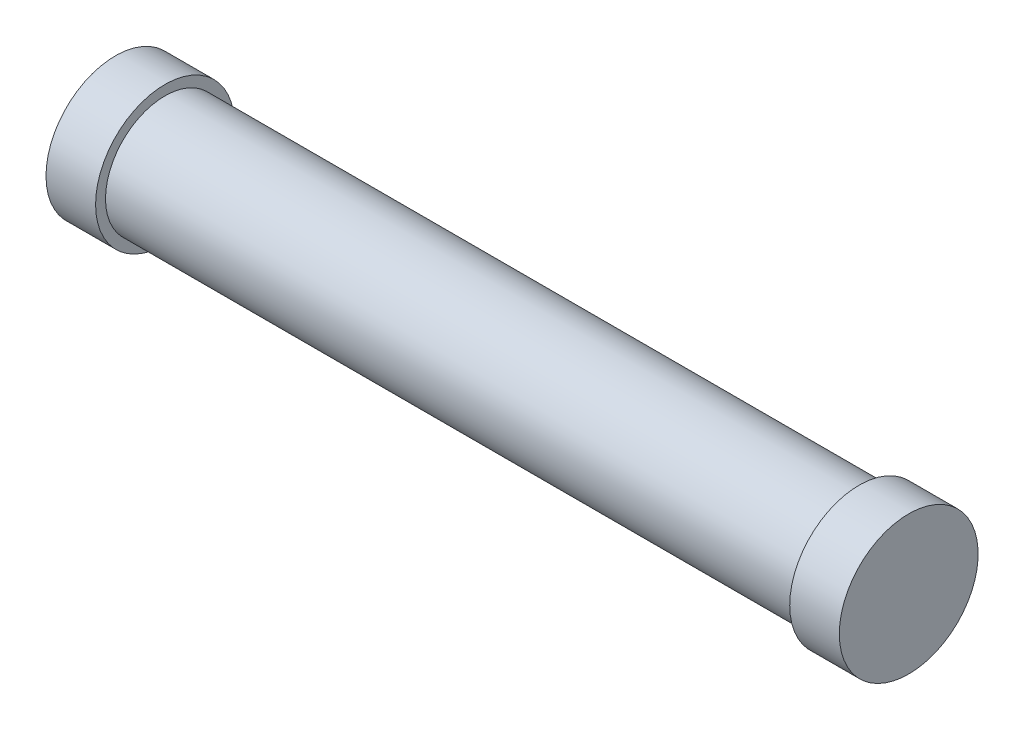
ISO-10303-21;
HEADER;
FILE_DESCRIPTION(('STEP AP214'),'2;1');
FILE_NAME('part.step','',(''),(''),'','','');
FILE_SCHEMA(('AUTOMOTIVE_DESIGN { 1 0 10303 214 1 1 1 1 }'));
ENDSEC;
DATA;
#1=APPLICATION_CONTEXT('core data for automotive mechanical design processes');
#2=APPLICATION_PROTOCOL_DEFINITION('international standard','automotive_design',2000,#1);
#3=PRODUCT_CONTEXT('',#1,'mechanical');
#4=PRODUCT('Part','Part','',(#3));
#5=PRODUCT_RELATED_PRODUCT_CATEGORY('part','',(#4));
#6=PRODUCT_DEFINITION_FORMATION('','',#4);
#7=PRODUCT_DEFINITION_CONTEXT('part definition',#1,'design');
#8=PRODUCT_DEFINITION('design','',#6,#7);
#9=PRODUCT_DEFINITION_SHAPE('','',#8);
#10=(LENGTH_UNIT() NAMED_UNIT(*) SI_UNIT(.MILLI.,.METRE.));
#11=(NAMED_UNIT(*) PLANE_ANGLE_UNIT() SI_UNIT($,.RADIAN.));
#12=(NAMED_UNIT(*) SI_UNIT($,.STERADIAN.) SOLID_ANGLE_UNIT());
#13=UNCERTAINTY_MEASURE_WITH_UNIT(LENGTH_MEASURE(1.E-05),#10,'distance_accuracy_value','');
#14=(GEOMETRIC_REPRESENTATION_CONTEXT(3) GLOBAL_UNCERTAINTY_ASSIGNED_CONTEXT((#13)) GLOBAL_UNIT_ASSIGNED_CONTEXT((#10,
#11,#12)) REPRESENTATION_CONTEXT('',''));
#15=CARTESIAN_POINT('',(0.,0.,0.));
#16=DIRECTION('',(0.,0.,1.));
#17=DIRECTION('',(1.,0.,0.));
#18=AXIS2_PLACEMENT_3D('',#15,#16,#17);
#19=CARTESIAN_POINT('',(-34.7204610951009,0.,-5.99999999999997));
#20=DIRECTION('',(-1.,0.,0.));
#21=DIRECTION('',(0.,0.,1.));
#22=AXIS2_PLACEMENT_3D('',#19,#20,#21);
#23=CYLINDRICAL_SURFACE('',#22,6.00000000000002);
#24=CARTESIAN_POINT('',(-34.7204610951009,0.,-5.99999999999997));
#25=DIRECTION('',(-1.,0.,0.));
#26=DIRECTION('',(0.,0.,1.));
#27=AXIS2_PLACEMENT_3D('',#24,#25,#26);
#28=CIRCLE('',#27,6.00000000000003);
#29=CARTESIAN_POINT('',(-34.7204610951009,0.,0.));
#30=VERTEX_POINT('',#29);
#31=EDGE_CURVE('E10',#30,#30,#28,.T.);
#32=ORIENTED_EDGE('',*,*,#31,.F.);
#33=EDGE_LOOP('',(#32));
#34=FACE_BOUND('',#33,.T.);
#35=CARTESIAN_POINT('',(35.2795389048992,0.,-5.99999999999997));
#36=DIRECTION('',(-1.,0.,0.));
#37=DIRECTION('',(0.,0.,1.));
#38=AXIS2_PLACEMENT_3D('',#35,#36,#37);
#39=CIRCLE('',#38,6.00000000000001);
#40=CARTESIAN_POINT('',(35.2795389048992,0.,0.));
#41=VERTEX_POINT('',#40);
#42=EDGE_CURVE('E34',#41,#41,#39,.T.);
#43=ORIENTED_EDGE('',*,*,#42,.T.);
#44=EDGE_LOOP('',(#43));
#45=FACE_BOUND('',#44,.T.);
#46=ADVANCED_FACE('F31',(#34,#45),#23,.T.);
#47=CARTESIAN_POINT('',(-39.7204610951009,0.,-5.99999999999997));
#48=DIRECTION('',(1.,0.,0.));
#49=DIRECTION('',(0.,0.,-1.));
#50=AXIS2_PLACEMENT_3D('',#47,#48,#49);
#51=CYLINDRICAL_SURFACE('',#50,7.);
#52=CARTESIAN_POINT('',(-39.7204610951009,0.,-5.99999999999997));
#53=DIRECTION('',(-1.,0.,0.));
#54=DIRECTION('',(0.,0.,1.));
#55=AXIS2_PLACEMENT_3D('',#52,#53,#54);
#56=CIRCLE('',#55,7.);
#57=CARTESIAN_POINT('',(-39.7204610951009,0.,1.00000000000003));
#58=VERTEX_POINT('',#57);
#59=EDGE_CURVE('E38',#58,#58,#56,.T.);
#60=ORIENTED_EDGE('',*,*,#59,.F.);
#61=EDGE_LOOP('',(#60));
#62=FACE_BOUND('',#61,.T.);
#63=CARTESIAN_POINT('',(-34.7204610951009,0.,-5.99999999999997));
#64=DIRECTION('',(-1.,0.,0.));
#65=DIRECTION('',(0.,0.,1.));
#66=AXIS2_PLACEMENT_3D('',#63,#64,#65);
#67=CIRCLE('',#66,7.);
#68=CARTESIAN_POINT('',(-34.7204610951009,0.,1.00000000000003));
#69=VERTEX_POINT('',#68);
#70=EDGE_CURVE('E42',#69,#69,#67,.T.);
#71=ORIENTED_EDGE('',*,*,#70,.T.);
#72=EDGE_LOOP('',(#71));
#73=FACE_BOUND('',#72,.T.);
#74=ADVANCED_FACE('F79',(#62,#73),#51,.T.);
#75=CARTESIAN_POINT('',(-39.7204610951009,0.,-5.99999999999997));
#76=DIRECTION('',(-1.,0.,0.));
#77=DIRECTION('',(0.,0.,1.));
#78=AXIS2_PLACEMENT_3D('',#75,#76,#77);
#79=PLANE('',#78);
#80=ORIENTED_EDGE('',*,*,#59,.T.);
#81=EDGE_LOOP('',(#80));
#82=FACE_BOUND('',#81,.T.);
#83=ADVANCED_FACE('F75',(#82),#79,.T.);
#84=CARTESIAN_POINT('',(-34.7204610951009,0.,-5.99999999999997));
#85=DIRECTION('',(-1.,0.,0.));
#86=DIRECTION('',(0.,0.,1.));
#87=AXIS2_PLACEMENT_3D('',#84,#85,#86);
#88=PLANE('',#87);
#89=ORIENTED_EDGE('',*,*,#31,.T.);
#90=EDGE_LOOP('',(#89));
#91=FACE_BOUND('',#90,.T.);
#92=ORIENTED_EDGE('',*,*,#70,.F.);
#93=EDGE_LOOP('',(#92));
#94=FACE_BOUND('',#93,.T.);
#95=ADVANCED_FACE('F67',(#91,#94),#88,.F.);
#96=CARTESIAN_POINT('',(40.2795389048992,0.,-5.99999999999997));
#97=DIRECTION('',(-1.,0.,0.));
#98=DIRECTION('',(0.,0.,1.));
#99=AXIS2_PLACEMENT_3D('',#96,#97,#98);
#100=CYLINDRICAL_SURFACE('',#99,7.);
#101=CARTESIAN_POINT('',(40.2795389048992,0.,-5.99999999999997));
#102=DIRECTION('',(-1.,0.,0.));
#103=DIRECTION('',(0.,0.,1.));
#104=AXIS2_PLACEMENT_3D('',#101,#102,#103);
#105=CIRCLE('',#104,7.);
#106=CARTESIAN_POINT('',(40.2795389048992,0.,1.00000000000003));
#107=VERTEX_POINT('',#106);
#108=EDGE_CURVE('E50',#107,#107,#105,.T.);
#109=ORIENTED_EDGE('',*,*,#108,.T.);
#110=EDGE_LOOP('',(#109));
#111=FACE_BOUND('',#110,.T.);
#112=CARTESIAN_POINT('',(35.2795389048992,0.,-5.99999999999997));
#113=DIRECTION('',(-1.,0.,0.));
#114=DIRECTION('',(0.,0.,1.));
#115=AXIS2_PLACEMENT_3D('',#112,#113,#114);
#116=CIRCLE('',#115,7.);
#117=CARTESIAN_POINT('',(35.2795389048992,0.,1.00000000000003));
#118=VERTEX_POINT('',#117);
#119=EDGE_CURVE('E47',#118,#118,#116,.T.);
#120=ORIENTED_EDGE('',*,*,#119,.F.);
#121=EDGE_LOOP('',(#120));
#122=FACE_BOUND('',#121,.T.);
#123=ADVANCED_FACE('F65',(#111,#122),#100,.T.);
#124=CARTESIAN_POINT('',(40.2795389048992,0.,-5.99999999999997));
#125=DIRECTION('',(1.,0.,0.));
#126=DIRECTION('',(0.,0.,1.));
#127=AXIS2_PLACEMENT_3D('',#124,#125,#126);
#128=PLANE('',#127);
#129=ORIENTED_EDGE('',*,*,#108,.F.);
#130=EDGE_LOOP('',(#129));
#131=FACE_BOUND('',#130,.T.);
#132=ADVANCED_FACE('F61',(#131),#128,.T.);
#133=CARTESIAN_POINT('',(35.2795389048992,0.,-5.99999999999997));
#134=DIRECTION('',(1.,0.,0.));
#135=DIRECTION('',(0.,0.,1.));
#136=AXIS2_PLACEMENT_3D('',#133,#134,#135);
#137=PLANE('',#136);
#138=ORIENTED_EDGE('',*,*,#42,.F.);
#139=EDGE_LOOP('',(#138));
#140=FACE_BOUND('',#139,.T.);
#141=ORIENTED_EDGE('',*,*,#119,.T.);
#142=EDGE_LOOP('',(#141));
#143=FACE_BOUND('',#142,.T.);
#144=ADVANCED_FACE('F58',(#140,#143),#137,.F.);
#145=CLOSED_SHELL('',(#46,#74,#83,#95,#123,#132,#144));
#146=MANIFOLD_SOLID_BREP('B2',#145);
#147=ADVANCED_BREP_SHAPE_REPRESENTATION('',(#18,#146),#14);
#148=SHAPE_DEFINITION_REPRESENTATION(#9,#147);
ENDSEC;
END-ISO-10303-21;
